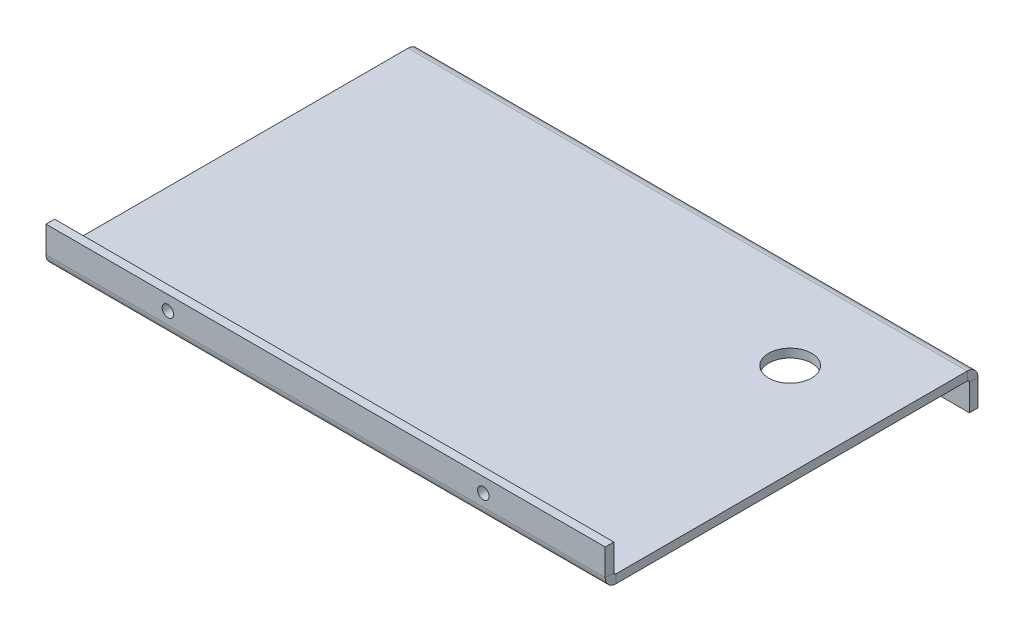
ISO-10303-21;
HEADER;
FILE_DESCRIPTION(('STEP AP214'),'2;1');
FILE_NAME('part.step','',(''),(''),'','','');
FILE_SCHEMA(('AUTOMOTIVE_DESIGN { 1 0 10303 214 1 1 1 1 }'));
ENDSEC;
DATA;
#1=APPLICATION_CONTEXT('core data for automotive mechanical design processes');
#2=APPLICATION_PROTOCOL_DEFINITION('international standard','automotive_design',2000,#1);
#3=PRODUCT_CONTEXT('',#1,'mechanical');
#4=PRODUCT('Part','Part','',(#3));
#5=PRODUCT_RELATED_PRODUCT_CATEGORY('part','',(#4));
#6=PRODUCT_DEFINITION_FORMATION('','',#4);
#7=PRODUCT_DEFINITION_CONTEXT('part definition',#1,'design');
#8=PRODUCT_DEFINITION('design','',#6,#7);
#9=PRODUCT_DEFINITION_SHAPE('','',#8);
#10=(LENGTH_UNIT() NAMED_UNIT(*) SI_UNIT(.MILLI.,.METRE.));
#11=(NAMED_UNIT(*) PLANE_ANGLE_UNIT() SI_UNIT($,.RADIAN.));
#12=(NAMED_UNIT(*) SI_UNIT($,.STERADIAN.) SOLID_ANGLE_UNIT());
#13=UNCERTAINTY_MEASURE_WITH_UNIT(LENGTH_MEASURE(1.E-05),#10,'distance_accuracy_value','');
#14=(GEOMETRIC_REPRESENTATION_CONTEXT(3) GLOBAL_UNCERTAINTY_ASSIGNED_CONTEXT((#13)) GLOBAL_UNIT_ASSIGNED_CONTEXT((#10,
#11,#12)) REPRESENTATION_CONTEXT('',''));
#15=CARTESIAN_POINT('',(0.,0.,0.));
#16=DIRECTION('',(0.,0.,1.));
#17=DIRECTION('',(1.,0.,0.));
#18=AXIS2_PLACEMENT_3D('',#15,#16,#17);
#19=CARTESIAN_POINT('',(97.5,-3.,65.));
#20=DIRECTION('',(1.,0.,0.));
#21=DIRECTION('',(0.,0.,-1.));
#22=AXIS2_PLACEMENT_3D('',#19,#20,#21);
#23=PLANE('',#22);
#24=DIRECTION('',(0.,0.,-1.));
#25=VECTOR('',#24,1.);
#26=CARTESIAN_POINT('',(97.5,-3.,65.));
#27=LINE('',#26,#25);
#28=CARTESIAN_POINT('',(97.5,-2.99999999999999,61.2634));
#29=VERTEX_POINT('',#28);
#30=CARTESIAN_POINT('',(97.5,-3.,-61.2634));
#31=VERTEX_POINT('',#30);
#32=EDGE_CURVE('E90',#29,#31,#27,.T.);
#33=ORIENTED_EDGE('',*,*,#32,.T.);
#34=DIRECTION('',(0.,1.,0.));
#35=VECTOR('',#34,1.);
#36=CARTESIAN_POINT('',(97.5,-3.00000000000001,-61.2634));
#37=LINE('',#36,#35);
#38=CARTESIAN_POINT('',(97.5,0.,-61.2634));
#39=VERTEX_POINT('',#38);
#40=EDGE_CURVE('E235',#31,#39,#37,.T.);
#41=ORIENTED_EDGE('',*,*,#40,.T.);
#42=DIRECTION('',(0.,0.,-1.));
#43=VECTOR('',#42,1.);
#44=CARTESIAN_POINT('',(97.5,0.,65.));
#45=LINE('',#44,#43);
#46=CARTESIAN_POINT('',(97.5,0.,61.2634));
#47=VERTEX_POINT('',#46);
#48=EDGE_CURVE('E325',#47,#39,#45,.T.);
#49=ORIENTED_EDGE('',*,*,#48,.F.);
#50=DIRECTION('',(0.,-1.,0.));
#51=VECTOR('',#50,1.);
#52=CARTESIAN_POINT('',(97.5,0.,61.2634));
#53=LINE('',#52,#51);
#54=EDGE_CURVE('E306',#47,#29,#53,.T.);
#55=ORIENTED_EDGE('',*,*,#54,.T.);
#56=EDGE_LOOP('',(#33,#41,#49,#55));
#57=FACE_BOUND('',#56,.T.);
#58=ADVANCED_FACE('F81',(#57),#23,.T.);
#59=CARTESIAN_POINT('',(0.,-3.,0.));
#60=DIRECTION('',(0.,-1.,0.));
#61=DIRECTION('',(0.,0.,-1.));
#62=AXIS2_PLACEMENT_3D('',#59,#60,#61);
#63=PLANE('',#62);
#64=CARTESIAN_POINT('',(65.,-3.,-32.));
#65=DIRECTION('',(0.,-1.,0.));
#66=DIRECTION('',(0.,0.,-1.));
#67=AXIS2_PLACEMENT_3D('',#64,#65,#66);
#68=CIRCLE('',#67,7.5);
#69=CARTESIAN_POINT('',(65.,-3.,-39.5));
#70=VERTEX_POINT('',#69);
#71=EDGE_CURVE('E721',#70,#70,#68,.T.);
#72=ORIENTED_EDGE('',*,*,#71,.F.);
#73=EDGE_LOOP('',(#72));
#74=FACE_BOUND('',#73,.T.);
#75=DIRECTION('',(0.,0.,1.));
#76=VECTOR('',#75,1.);
#77=CARTESIAN_POINT('',(-97.5,-3.,65.));
#78=LINE('',#77,#76);
#79=CARTESIAN_POINT('',(-97.5,-3.,-61.2634));
#80=VERTEX_POINT('',#79);
#81=CARTESIAN_POINT('',(-97.5,-3.,61.2634));
#82=VERTEX_POINT('',#81);
#83=EDGE_CURVE('E13',#80,#82,#78,.T.);
#84=ORIENTED_EDGE('',*,*,#83,.F.);
#85=DIRECTION('',(1.,0.,0.));
#86=VECTOR('',#85,1.);
#87=CARTESIAN_POINT('',(97.5,-3.00000000000001,-61.2634));
#88=LINE('',#87,#86);
#89=EDGE_CURVE('E98',#31,#80,#88,.F.);
#90=ORIENTED_EDGE('',*,*,#89,.F.);
#91=ORIENTED_EDGE('',*,*,#32,.F.);
#92=DIRECTION('',(1.,0.,0.));
#93=VECTOR('',#92,1.);
#94=CARTESIAN_POINT('',(97.4999999999999,-2.99999999999999,61.2634));
#95=LINE('',#94,#93);
#96=EDGE_CURVE('E297',#29,#82,#95,.F.);
#97=ORIENTED_EDGE('',*,*,#96,.T.);
#98=EDGE_LOOP('',(#84,#90,#91,#97));
#99=FACE_BOUND('',#98,.T.);
#100=ADVANCED_FACE('F409',(#74,#99),#63,.T.);
#101=CARTESIAN_POINT('',(0.,0.,0.));
#102=DIRECTION('',(0.,-1.,0.));
#103=DIRECTION('',(0.,0.,-1.));
#104=AXIS2_PLACEMENT_3D('',#101,#102,#103);
#105=PLANE('',#104);
#106=CARTESIAN_POINT('',(65.,0.,-32.));
#107=DIRECTION('',(0.,-1.,0.));
#108=DIRECTION('',(0.,0.,-1.));
#109=AXIS2_PLACEMENT_3D('',#106,#107,#108);
#110=CIRCLE('',#109,7.5);
#111=CARTESIAN_POINT('',(65.,0.,-39.5));
#112=VERTEX_POINT('',#111);
#113=EDGE_CURVE('E360',#112,#112,#110,.F.);
#114=ORIENTED_EDGE('',*,*,#113,.F.);
#115=EDGE_LOOP('',(#114));
#116=FACE_BOUND('',#115,.T.);
#117=DIRECTION('',(1.,0.,0.));
#118=VECTOR('',#117,1.);
#119=CARTESIAN_POINT('',(97.5,0.,-61.2634));
#120=LINE('',#119,#118);
#121=CARTESIAN_POINT('',(-97.5,0.,-61.2634));
#122=VERTEX_POINT('',#121);
#123=EDGE_CURVE('E226',#39,#122,#120,.F.);
#124=ORIENTED_EDGE('',*,*,#123,.T.);
#125=DIRECTION('',(0.,0.,1.));
#126=VECTOR('',#125,1.);
#127=CARTESIAN_POINT('',(-97.5,0.,65.));
#128=LINE('',#127,#126);
#129=CARTESIAN_POINT('',(-97.5,0.,61.2634));
#130=VERTEX_POINT('',#129);
#131=EDGE_CURVE('E330',#122,#130,#128,.T.);
#132=ORIENTED_EDGE('',*,*,#131,.T.);
#133=DIRECTION('',(1.,0.,0.));
#134=VECTOR('',#133,1.);
#135=CARTESIAN_POINT('',(97.4999999999999,0.,61.2634));
#136=LINE('',#135,#134);
#137=EDGE_CURVE('E314',#47,#130,#136,.F.);
#138=ORIENTED_EDGE('',*,*,#137,.F.);
#139=ORIENTED_EDGE('',*,*,#48,.T.);
#140=EDGE_LOOP('',(#124,#132,#138,#139));
#141=FACE_BOUND('',#140,.T.);
#142=ADVANCED_FACE('F392',(#116,#141),#105,.F.);
#143=CARTESIAN_POINT('',(-97.5,-3.,65.));
#144=DIRECTION('',(-1.,0.,0.));
#145=DIRECTION('',(0.,0.,1.));
#146=AXIS2_PLACEMENT_3D('',#143,#144,#145);
#147=PLANE('',#146);
#148=DIRECTION('',(0.,1.,0.));
#149=VECTOR('',#148,1.);
#150=CARTESIAN_POINT('',(-97.5,-3.00000000000001,-61.2634));
#151=LINE('',#150,#149);
#152=EDGE_CURVE('E105',#80,#122,#151,.T.);
#153=ORIENTED_EDGE('',*,*,#152,.F.);
#154=ORIENTED_EDGE('',*,*,#83,.T.);
#155=DIRECTION('',(0.,-1.,0.));
#156=VECTOR('',#155,1.);
#157=CARTESIAN_POINT('',(-97.5,0.,61.2634));
#158=LINE('',#157,#156);
#159=EDGE_CURVE('E321',#130,#82,#158,.T.);
#160=ORIENTED_EDGE('',*,*,#159,.F.);
#161=ORIENTED_EDGE('',*,*,#131,.F.);
#162=EDGE_LOOP('',(#153,#154,#160,#161));
#163=FACE_BOUND('',#162,.T.);
#164=ADVANCED_FACE('F418',(#163),#147,.T.);
#165=CARTESIAN_POINT('',(-97.5,0.736600000000004,61.2634));
#166=DIRECTION('',(-1.,0.,0.));
#167=DIRECTION('',(0.,0.,1.));
#168=AXIS2_PLACEMENT_3D('',#165,#166,#167);
#169=PLANE('',#168);
#170=DIRECTION('',(0.,0.,-1.));
#171=VECTOR('',#170,1.);
#172=CARTESIAN_POINT('',(-97.5,0.736600000000004,65.));
#173=LINE('',#172,#171);
#174=CARTESIAN_POINT('',(-97.5,0.736600000000004,62.));
#175=VERTEX_POINT('',#174);
#176=CARTESIAN_POINT('',(-97.4999999999999,0.736600000000004,65.));
#177=VERTEX_POINT('',#176);
#178=EDGE_CURVE('E251',#175,#177,#173,.F.);
#179=ORIENTED_EDGE('',*,*,#178,.F.);
#180=CARTESIAN_POINT('',(-97.5,0.736600000000004,61.2634));
#181=DIRECTION('',(1.,0.,0.));
#182=DIRECTION('',(0.,0.,-1.));
#183=AXIS2_PLACEMENT_3D('',#180,#181,#182);
#184=CIRCLE('',#183,0.736599999999997);
#185=EDGE_CURVE('E310',#130,#175,#184,.F.);
#186=ORIENTED_EDGE('',*,*,#185,.F.);
#187=ORIENTED_EDGE('',*,*,#159,.T.);
#188=CARTESIAN_POINT('',(-97.4999999999999,0.736600000000004,61.2634));
#189=DIRECTION('',(1.,0.,0.));
#190=DIRECTION('',(0.,0.,-1.));
#191=AXIS2_PLACEMENT_3D('',#188,#189,#190);
#192=CIRCLE('',#191,3.7366);
#193=EDGE_CURVE('E301',#82,#177,#192,.F.);
#194=ORIENTED_EDGE('',*,*,#193,.T.);
#195=EDGE_LOOP('',(#179,#186,#187,#194));
#196=FACE_BOUND('',#195,.T.);
#197=ADVANCED_FACE('F426',(#196),#169,.T.);
#198=CARTESIAN_POINT('',(97.5,0.736600000000004,61.2634));
#199=DIRECTION('',(-1.,0.,0.));
#200=DIRECTION('',(0.,0.,1.));
#201=AXIS2_PLACEMENT_3D('',#198,#199,#200);
#202=PLANE('',#201);
#203=CARTESIAN_POINT('',(97.5,0.736600000000004,61.2634));
#204=DIRECTION('',(1.,0.,0.));
#205=DIRECTION('',(0.,0.,-1.));
#206=AXIS2_PLACEMENT_3D('',#203,#204,#205);
#207=CIRCLE('',#206,0.736599999999997);
#208=CARTESIAN_POINT('',(97.5,0.736600000000004,62.));
#209=VERTEX_POINT('',#208);
#210=EDGE_CURVE('E259',#209,#47,#207,.T.);
#211=ORIENTED_EDGE('',*,*,#210,.F.);
#212=DIRECTION('',(0.,0.,-1.));
#213=VECTOR('',#212,1.);
#214=CARTESIAN_POINT('',(97.5,0.736600000000004,62.));
#215=LINE('',#214,#213);
#216=CARTESIAN_POINT('',(97.5,0.736600000000004,65.));
#217=VERTEX_POINT('',#216);
#218=EDGE_CURVE('E287',#209,#217,#215,.F.);
#219=ORIENTED_EDGE('',*,*,#218,.T.);
#220=CARTESIAN_POINT('',(97.5,0.736600000000004,61.2634));
#221=DIRECTION('',(1.,0.,0.));
#222=DIRECTION('',(0.,0.,-1.));
#223=AXIS2_PLACEMENT_3D('',#220,#221,#222);
#224=CIRCLE('',#223,3.7366);
#225=EDGE_CURVE('E302',#217,#29,#224,.T.);
#226=ORIENTED_EDGE('',*,*,#225,.T.);
#227=ORIENTED_EDGE('',*,*,#54,.F.);
#228=EDGE_LOOP('',(#211,#219,#226,#227));
#229=FACE_BOUND('',#228,.T.);
#230=ADVANCED_FACE('F423',(#229),#202,.F.);
#231=CARTESIAN_POINT('',(97.4999999999999,0.736600000000004,61.2634));
#232=DIRECTION('',(1.,0.,0.));
#233=DIRECTION('',(0.,0.,1.));
#234=AXIS2_PLACEMENT_3D('',#231,#232,#233);
#235=CYLINDRICAL_SURFACE('',#234,3.7366);
#236=ORIENTED_EDGE('',*,*,#96,.F.);
#237=ORIENTED_EDGE('',*,*,#225,.F.);
#238=DIRECTION('',(1.,0.,0.));
#239=VECTOR('',#238,1.);
#240=CARTESIAN_POINT('',(-97.5,0.736600000000004,65.));
#241=LINE('',#240,#239);
#242=EDGE_CURVE('E284',#217,#177,#241,.F.);
#243=ORIENTED_EDGE('',*,*,#242,.T.);
#244=ORIENTED_EDGE('',*,*,#193,.F.);
#245=EDGE_LOOP('',(#236,#237,#243,#244));
#246=FACE_BOUND('',#245,.T.);
#247=ADVANCED_FACE('F434',(#246),#235,.T.);
#248=CARTESIAN_POINT('',(97.4999999999999,0.736600000000004,61.2634));
#249=DIRECTION('',(1.,0.,0.));
#250=DIRECTION('',(0.,0.,1.));
#251=AXIS2_PLACEMENT_3D('',#248,#249,#250);
#252=CYLINDRICAL_SURFACE('',#251,0.736599999999997);
#253=ORIENTED_EDGE('',*,*,#137,.T.);
#254=ORIENTED_EDGE('',*,*,#185,.T.);
#255=DIRECTION('',(1.,0.,0.));
#256=VECTOR('',#255,1.);
#257=CARTESIAN_POINT('',(-97.5,0.736600000000004,62.));
#258=LINE('',#257,#256);
#259=EDGE_CURVE('E291',#175,#209,#258,.T.);
#260=ORIENTED_EDGE('',*,*,#259,.T.);
#261=ORIENTED_EDGE('',*,*,#210,.T.);
#262=EDGE_LOOP('',(#253,#254,#260,#261));
#263=FACE_BOUND('',#262,.T.);
#264=ADVANCED_FACE('F437',(#263),#252,.F.);
#265=CARTESIAN_POINT('',(97.5,10.,65.));
#266=DIRECTION('',(-1.,0.,0.));
#267=DIRECTION('',(0.,-1.,0.));
#268=AXIS2_PLACEMENT_3D('',#265,#266,#267);
#269=PLANE('',#268);
#270=ORIENTED_EDGE('',*,*,#218,.F.);
#271=DIRECTION('',(0.,-1.,0.));
#272=VECTOR('',#271,1.);
#273=CARTESIAN_POINT('',(97.5,10.,62.));
#274=LINE('',#273,#272);
#275=CARTESIAN_POINT('',(97.5,10.,62.));
#276=VERTEX_POINT('',#275);
#277=EDGE_CURVE('E281',#209,#276,#274,.F.);
#278=ORIENTED_EDGE('',*,*,#277,.T.);
#279=DIRECTION('',(0.,0.,-1.));
#280=VECTOR('',#279,1.);
#281=CARTESIAN_POINT('',(97.5,10.,65.));
#282=LINE('',#281,#280);
#283=CARTESIAN_POINT('',(97.5,10.,65.));
#284=VERTEX_POINT('',#283);
#285=EDGE_CURVE('E255',#284,#276,#282,.T.);
#286=ORIENTED_EDGE('',*,*,#285,.F.);
#287=DIRECTION('',(0.,1.,0.));
#288=VECTOR('',#287,1.);
#289=CARTESIAN_POINT('',(97.5,-4.05925293378573E-13,65.));
#290=LINE('',#289,#288);
#291=EDGE_CURVE('E271',#217,#284,#290,.T.);
#292=ORIENTED_EDGE('',*,*,#291,.F.);
#293=EDGE_LOOP('',(#270,#278,#286,#292));
#294=FACE_BOUND('',#293,.T.);
#295=ADVANCED_FACE('F440',(#294),#269,.F.);
#296=CARTESIAN_POINT('',(-97.5,0.,65.));
#297=DIRECTION('',(1.,0.,0.));
#298=DIRECTION('',(0.,1.,0.));
#299=AXIS2_PLACEMENT_3D('',#296,#297,#298);
#300=PLANE('',#299);
#301=ORIENTED_EDGE('',*,*,#178,.T.);
#302=DIRECTION('',(0.,-1.,0.));
#303=VECTOR('',#302,1.);
#304=CARTESIAN_POINT('',(-97.5,5.41233724504764E-13,65.));
#305=LINE('',#304,#303);
#306=CARTESIAN_POINT('',(-97.5,10.,65.));
#307=VERTEX_POINT('',#306);
#308=EDGE_CURVE('E264',#307,#177,#305,.T.);
#309=ORIENTED_EDGE('',*,*,#308,.F.);
#310=DIRECTION('',(0.,0.,-1.));
#311=VECTOR('',#310,1.);
#312=CARTESIAN_POINT('',(-97.5,10.,65.));
#313=LINE('',#312,#311);
#314=CARTESIAN_POINT('',(-97.5,10.,62.));
#315=VERTEX_POINT('',#314);
#316=EDGE_CURVE('E260',#307,#315,#313,.T.);
#317=ORIENTED_EDGE('',*,*,#316,.T.);
#318=DIRECTION('',(0.,1.,0.));
#319=VECTOR('',#318,1.);
#320=CARTESIAN_POINT('',(-97.5,0.,62.));
#321=LINE('',#320,#319);
#322=EDGE_CURVE('E274',#315,#175,#321,.F.);
#323=ORIENTED_EDGE('',*,*,#322,.T.);
#324=EDGE_LOOP('',(#301,#309,#317,#323));
#325=FACE_BOUND('',#324,.T.);
#326=ADVANCED_FACE('F446',(#325),#300,.F.);
#327=CARTESIAN_POINT('',(0.,0.,65.));
#328=DIRECTION('',(0.,0.,-1.));
#329=DIRECTION('',(-1.,0.,0.));
#330=AXIS2_PLACEMENT_3D('',#327,#328,#329);
#331=PLANE('',#330);
#332=CARTESIAN_POINT('',(-55.,5.00000000000001,65.));
#333=DIRECTION('',(0.,0.,1.));
#334=DIRECTION('',(1.,0.,0.));
#335=AXIS2_PLACEMENT_3D('',#332,#333,#334);
#336=CIRCLE('',#335,2.);
#337=CARTESIAN_POINT('',(-53.,5.00000000000001,65.));
#338=VERTEX_POINT('',#337);
#339=EDGE_CURVE('E340',#338,#338,#336,.T.);
#340=ORIENTED_EDGE('',*,*,#339,.F.);
#341=EDGE_LOOP('',(#340));
#342=FACE_BOUND('',#341,.T.);
#343=CARTESIAN_POINT('',(55.,5.00000000000002,65.));
#344=DIRECTION('',(0.,0.,1.));
#345=DIRECTION('',(-1.,0.,0.));
#346=AXIS2_PLACEMENT_3D('',#343,#344,#345);
#347=CIRCLE('',#346,2.);
#348=CARTESIAN_POINT('',(53.,5.00000000000002,65.));
#349=VERTEX_POINT('',#348);
#350=EDGE_CURVE('E352',#349,#349,#347,.T.);
#351=ORIENTED_EDGE('',*,*,#350,.F.);
#352=EDGE_LOOP('',(#351));
#353=FACE_BOUND('',#352,.T.);
#354=ORIENTED_EDGE('',*,*,#242,.F.);
#355=ORIENTED_EDGE('',*,*,#291,.T.);
#356=DIRECTION('',(-1.,0.,0.));
#357=VECTOR('',#356,1.);
#358=CARTESIAN_POINT('',(0.,10.,65.));
#359=LINE('',#358,#357);
#360=EDGE_CURVE('E268',#284,#307,#359,.T.);
#361=ORIENTED_EDGE('',*,*,#360,.T.);
#362=ORIENTED_EDGE('',*,*,#308,.T.);
#363=EDGE_LOOP('',(#354,#355,#361,#362));
#364=FACE_BOUND('',#363,.T.);
#365=ADVANCED_FACE('F451',(#342,#353,#364),#331,.F.);
#366=CARTESIAN_POINT('',(0.,0.,62.));
#367=DIRECTION('',(0.,0.,-1.));
#368=DIRECTION('',(-1.,0.,0.));
#369=AXIS2_PLACEMENT_3D('',#366,#367,#368);
#370=PLANE('',#369);
#371=CARTESIAN_POINT('',(-55.,5.00000000000001,62.));
#372=DIRECTION('',(0.,0.,-1.));
#373=DIRECTION('',(-1.,0.,0.));
#374=AXIS2_PLACEMENT_3D('',#371,#372,#373);
#375=CIRCLE('',#374,2.);
#376=CARTESIAN_POINT('',(-57.,5.00000000000001,62.));
#377=VERTEX_POINT('',#376);
#378=EDGE_CURVE('E225',#377,#377,#375,.T.);
#379=ORIENTED_EDGE('',*,*,#378,.F.);
#380=EDGE_LOOP('',(#379));
#381=FACE_BOUND('',#380,.T.);
#382=CARTESIAN_POINT('',(55.,5.00000000000002,62.));
#383=DIRECTION('',(0.,0.,-1.));
#384=DIRECTION('',(-1.,0.,0.));
#385=AXIS2_PLACEMENT_3D('',#382,#383,#384);
#386=CIRCLE('',#385,2.);
#387=CARTESIAN_POINT('',(53.,5.00000000000002,62.));
#388=VERTEX_POINT('',#387);
#389=EDGE_CURVE('E336',#388,#388,#386,.T.);
#390=ORIENTED_EDGE('',*,*,#389,.F.);
#391=EDGE_LOOP('',(#390));
#392=FACE_BOUND('',#391,.T.);
#393=ORIENTED_EDGE('',*,*,#277,.F.);
#394=ORIENTED_EDGE('',*,*,#259,.F.);
#395=ORIENTED_EDGE('',*,*,#322,.F.);
#396=DIRECTION('',(1.,0.,0.));
#397=VECTOR('',#396,1.);
#398=CARTESIAN_POINT('',(-97.5,10.,62.));
#399=LINE('',#398,#397);
#400=EDGE_CURVE('E278',#276,#315,#399,.F.);
#401=ORIENTED_EDGE('',*,*,#400,.F.);
#402=EDGE_LOOP('',(#393,#394,#395,#401));
#403=FACE_BOUND('',#402,.T.);
#404=ADVANCED_FACE('F404',(#381,#392,#403),#370,.T.);
#405=CARTESIAN_POINT('',(-97.5,10.,65.));
#406=DIRECTION('',(0.,-1.,0.));
#407=DIRECTION('',(0.,0.,-1.));
#408=AXIS2_PLACEMENT_3D('',#405,#406,#407);
#409=PLANE('',#408);
#410=ORIENTED_EDGE('',*,*,#400,.T.);
#411=ORIENTED_EDGE('',*,*,#316,.F.);
#412=ORIENTED_EDGE('',*,*,#360,.F.);
#413=ORIENTED_EDGE('',*,*,#285,.T.);
#414=EDGE_LOOP('',(#410,#411,#412,#413));
#415=FACE_BOUND('',#414,.T.);
#416=ADVANCED_FACE('F397',(#415),#409,.F.);
#417=CARTESIAN_POINT('',(-97.5,-3.73660000000001,-61.2634));
#418=DIRECTION('',(-1.,0.,0.));
#419=DIRECTION('',(0.,0.,1.));
#420=AXIS2_PLACEMENT_3D('',#417,#418,#419);
#421=PLANE('',#420);
#422=DIRECTION('',(0.,0.,1.));
#423=VECTOR('',#422,1.);
#424=CARTESIAN_POINT('',(-97.5,-3.73659999999999,-65.));
#425=LINE('',#424,#423);
#426=CARTESIAN_POINT('',(-97.5,-3.73660000000001,-62.));
#427=VERTEX_POINT('',#426);
#428=CARTESIAN_POINT('',(-97.5,-3.7366,-65.));
#429=VERTEX_POINT('',#428);
#430=EDGE_CURVE('E198',#427,#429,#425,.F.);
#431=ORIENTED_EDGE('',*,*,#430,.F.);
#432=CARTESIAN_POINT('',(-97.5,-3.73660000000001,-61.2634));
#433=DIRECTION('',(1.,0.,0.));
#434=DIRECTION('',(0.,0.,-1.));
#435=AXIS2_PLACEMENT_3D('',#432,#433,#434);
#436=CIRCLE('',#435,0.736599999999997);
#437=EDGE_CURVE('E239',#80,#427,#436,.F.);
#438=ORIENTED_EDGE('',*,*,#437,.F.);
#439=ORIENTED_EDGE('',*,*,#152,.T.);
#440=CARTESIAN_POINT('',(-97.5,-3.73660000000001,-61.2634));
#441=DIRECTION('',(1.,0.,0.));
#442=DIRECTION('',(0.,0.,-1.));
#443=AXIS2_PLACEMENT_3D('',#440,#441,#442);
#444=CIRCLE('',#443,3.7366);
#445=EDGE_CURVE('E230',#122,#429,#444,.F.);
#446=ORIENTED_EDGE('',*,*,#445,.T.);
#447=EDGE_LOOP('',(#431,#438,#439,#446));
#448=FACE_BOUND('',#447,.T.);
#449=ADVANCED_FACE('F395',(#448),#421,.T.);
#450=CARTESIAN_POINT('',(97.5,-3.73660000000001,-61.2634));
#451=DIRECTION('',(-1.,0.,0.));
#452=DIRECTION('',(0.,0.,1.));
#453=AXIS2_PLACEMENT_3D('',#450,#451,#452);
#454=PLANE('',#453);
#455=CARTESIAN_POINT('',(97.5,-3.73660000000001,-61.2634));
#456=DIRECTION('',(1.,0.,0.));
#457=DIRECTION('',(0.,0.,-1.));
#458=AXIS2_PLACEMENT_3D('',#455,#456,#457);
#459=CIRCLE('',#458,0.736599999999997);
#460=CARTESIAN_POINT('',(97.5,-3.73660000000001,-62.));
#461=VERTEX_POINT('',#460);
#462=EDGE_CURVE('E245',#461,#31,#459,.T.);
#463=ORIENTED_EDGE('',*,*,#462,.F.);
#464=DIRECTION('',(0.,0.,1.));
#465=VECTOR('',#464,1.);
#466=CARTESIAN_POINT('',(97.5,-3.73660000000001,-62.));
#467=LINE('',#466,#465);
#468=CARTESIAN_POINT('',(97.5,-3.73659999999999,-65.));
#469=VERTEX_POINT('',#468);
#470=EDGE_CURVE('E216',#461,#469,#467,.F.);
#471=ORIENTED_EDGE('',*,*,#470,.T.);
#472=CARTESIAN_POINT('',(97.5,-3.73660000000001,-61.2634));
#473=DIRECTION('',(1.,0.,0.));
#474=DIRECTION('',(0.,0.,-1.));
#475=AXIS2_PLACEMENT_3D('',#472,#473,#474);
#476=CIRCLE('',#475,3.7366);
#477=EDGE_CURVE('E231',#469,#39,#476,.T.);
#478=ORIENTED_EDGE('',*,*,#477,.T.);
#479=ORIENTED_EDGE('',*,*,#40,.F.);
#480=EDGE_LOOP('',(#463,#471,#478,#479));
#481=FACE_BOUND('',#480,.T.);
#482=ADVANCED_FACE('F384',(#481),#454,.F.);
#483=CARTESIAN_POINT('',(97.5,-3.73660000000001,-61.2634));
#484=DIRECTION('',(1.,0.,0.));
#485=DIRECTION('',(0.,0.,-1.));
#486=AXIS2_PLACEMENT_3D('',#483,#484,#485);
#487=CYLINDRICAL_SURFACE('',#486,3.7366);
#488=ORIENTED_EDGE('',*,*,#123,.F.);
#489=ORIENTED_EDGE('',*,*,#477,.F.);
#490=DIRECTION('',(1.,0.,0.));
#491=VECTOR('',#490,1.);
#492=CARTESIAN_POINT('',(-97.5,-3.73659999999999,-65.));
#493=LINE('',#492,#491);
#494=EDGE_CURVE('E213',#469,#429,#493,.F.);
#495=ORIENTED_EDGE('',*,*,#494,.T.);
#496=ORIENTED_EDGE('',*,*,#445,.F.);
#497=EDGE_LOOP('',(#488,#489,#495,#496));
#498=FACE_BOUND('',#497,.T.);
#499=ADVANCED_FACE('F390',(#498),#487,.T.);
#500=CARTESIAN_POINT('',(97.5,-3.73660000000001,-61.2634));
#501=DIRECTION('',(1.,0.,0.));
#502=DIRECTION('',(0.,0.,-1.));
#503=AXIS2_PLACEMENT_3D('',#500,#501,#502);
#504=CYLINDRICAL_SURFACE('',#503,0.736599999999997);
#505=ORIENTED_EDGE('',*,*,#89,.T.);
#506=ORIENTED_EDGE('',*,*,#437,.T.);
#507=DIRECTION('',(1.,0.,0.));
#508=VECTOR('',#507,1.);
#509=CARTESIAN_POINT('',(-97.5,-3.73660000000001,-62.));
#510=LINE('',#509,#508);
#511=EDGE_CURVE('E220',#427,#461,#510,.T.);
#512=ORIENTED_EDGE('',*,*,#511,.T.);
#513=ORIENTED_EDGE('',*,*,#462,.T.);
#514=EDGE_LOOP('',(#505,#506,#512,#513));
#515=FACE_BOUND('',#514,.T.);
#516=ADVANCED_FACE('F380',(#515),#504,.F.);
#517=CARTESIAN_POINT('',(97.5,-13.,-65.));
#518=DIRECTION('',(-1.,0.,0.));
#519=DIRECTION('',(0.,-1.,0.));
#520=AXIS2_PLACEMENT_3D('',#517,#518,#519);
#521=PLANE('',#520);
#522=ORIENTED_EDGE('',*,*,#470,.F.);
#523=DIRECTION('',(0.,1.,0.));
#524=VECTOR('',#523,1.);
#525=CARTESIAN_POINT('',(97.5,-13.,-62.));
#526=LINE('',#525,#524);
#527=CARTESIAN_POINT('',(97.5,-13.,-62.));
#528=VERTEX_POINT('',#527);
#529=EDGE_CURVE('E210',#461,#528,#526,.F.);
#530=ORIENTED_EDGE('',*,*,#529,.T.);
#531=DIRECTION('',(0.,0.,1.));
#532=VECTOR('',#531,1.);
#533=CARTESIAN_POINT('',(97.5,-13.,-65.));
#534=LINE('',#533,#532);
#535=CARTESIAN_POINT('',(97.5,-13.,-65.));
#536=VERTEX_POINT('',#535);
#537=EDGE_CURVE('E194',#536,#528,#534,.T.);
#538=ORIENTED_EDGE('',*,*,#537,.F.);
#539=DIRECTION('',(0.,-1.,0.));
#540=VECTOR('',#539,1.);
#541=CARTESIAN_POINT('',(97.4999999999999,6.87016599647484E-13,-65.));
#542=LINE('',#541,#540);
#543=EDGE_CURVE('E179',#469,#536,#542,.T.);
#544=ORIENTED_EDGE('',*,*,#543,.F.);
#545=EDGE_LOOP('',(#522,#530,#538,#544));
#546=FACE_BOUND('',#545,.T.);
#547=ADVANCED_FACE('F373',(#546),#521,.F.);
#548=CARTESIAN_POINT('',(-97.5,-2.99999999999999,-65.));
#549=DIRECTION('',(1.,0.,0.));
#550=DIRECTION('',(0.,1.,0.));
#551=AXIS2_PLACEMENT_3D('',#548,#549,#550);
#552=PLANE('',#551);
#553=ORIENTED_EDGE('',*,*,#430,.T.);
#554=DIRECTION('',(0.,1.,0.));
#555=VECTOR('',#554,1.);
#556=CARTESIAN_POINT('',(-97.5000000000001,-2.60142418235853E-13,-65.));
#557=LINE('',#556,#555);
#558=CARTESIAN_POINT('',(-97.5,-13.,-65.));
#559=VERTEX_POINT('',#558);
#560=EDGE_CURVE('E177',#559,#429,#557,.T.);
#561=ORIENTED_EDGE('',*,*,#560,.F.);
#562=DIRECTION('',(0.,0.,1.));
#563=VECTOR('',#562,1.);
#564=CARTESIAN_POINT('',(-97.5,-13.,-65.));
#565=LINE('',#564,#563);
#566=CARTESIAN_POINT('',(-97.5,-13.,-62.));
#567=VERTEX_POINT('',#566);
#568=EDGE_CURVE('E186',#559,#567,#565,.T.);
#569=ORIENTED_EDGE('',*,*,#568,.T.);
#570=DIRECTION('',(0.,-1.,0.));
#571=VECTOR('',#570,1.);
#572=CARTESIAN_POINT('',(-97.5,-3.,-62.));
#573=LINE('',#572,#571);
#574=EDGE_CURVE('E205',#567,#427,#573,.F.);
#575=ORIENTED_EDGE('',*,*,#574,.T.);
#576=EDGE_LOOP('',(#553,#561,#569,#575));
#577=FACE_BOUND('',#576,.T.);
#578=ADVANCED_FACE('F197',(#577),#552,.F.);
#579=CARTESIAN_POINT('',(0.,2.81091306268911E-13,-65.));
#580=DIRECTION('',(0.,0.,1.));
#581=DIRECTION('',(0.,-1.,0.));
#582=AXIS2_PLACEMENT_3D('',#579,#580,#581);
#583=PLANE('',#582);
#584=CARTESIAN_POINT('',(55.,-7.9999999999999,-65.));
#585=DIRECTION('',(0.,0.,-1.));
#586=DIRECTION('',(0.,1.,0.));
#587=AXIS2_PLACEMENT_3D('',#584,#585,#586);
#588=CIRCLE('',#587,2.);
#589=CARTESIAN_POINT('',(55.,-5.9999999999999,-65.));
#590=VERTEX_POINT('',#589);
#591=EDGE_CURVE('E346',#590,#590,#588,.T.);
#592=ORIENTED_EDGE('',*,*,#591,.F.);
#593=EDGE_LOOP('',(#592));
#594=FACE_BOUND('',#593,.T.);
#595=CARTESIAN_POINT('',(-55.,-7.99999999999989,-65.));
#596=DIRECTION('',(0.,0.,-1.));
#597=DIRECTION('',(0.,-1.,0.));
#598=AXIS2_PLACEMENT_3D('',#595,#596,#597);
#599=CIRCLE('',#598,2.);
#600=CARTESIAN_POINT('',(-55.,-9.99999999999989,-65.));
#601=VERTEX_POINT('',#600);
#602=EDGE_CURVE('E354',#601,#601,#599,.T.);
#603=ORIENTED_EDGE('',*,*,#602,.F.);
#604=EDGE_LOOP('',(#603));
#605=FACE_BOUND('',#604,.T.);
#606=ORIENTED_EDGE('',*,*,#494,.F.);
#607=ORIENTED_EDGE('',*,*,#543,.T.);
#608=DIRECTION('',(-1.,0.,0.));
#609=VECTOR('',#608,1.);
#610=CARTESIAN_POINT('',(0.,-13.,-65.));
#611=LINE('',#610,#609);
#612=EDGE_CURVE('E172',#536,#559,#611,.T.);
#613=ORIENTED_EDGE('',*,*,#612,.T.);
#614=ORIENTED_EDGE('',*,*,#560,.T.);
#615=EDGE_LOOP('',(#606,#607,#613,#614));
#616=FACE_BOUND('',#615,.T.);
#617=ADVANCED_FACE('F175',(#594,#605,#616),#583,.F.);
#618=CARTESIAN_POINT('',(0.,2.70616862252382E-13,-62.));
#619=DIRECTION('',(0.,0.,1.));
#620=DIRECTION('',(0.,-1.,0.));
#621=AXIS2_PLACEMENT_3D('',#618,#619,#620);
#622=PLANE('',#621);
#623=CARTESIAN_POINT('',(55.,-7.99999999999991,-62.));
#624=DIRECTION('',(0.,0.,1.));
#625=DIRECTION('',(0.,-1.,0.));
#626=AXIS2_PLACEMENT_3D('',#623,#624,#625);
#627=CIRCLE('',#626,2.);
#628=CARTESIAN_POINT('',(55.,-9.99999999999991,-62.));
#629=VERTEX_POINT('',#628);
#630=EDGE_CURVE('E84',#629,#629,#627,.T.);
#631=ORIENTED_EDGE('',*,*,#630,.F.);
#632=EDGE_LOOP('',(#631));
#633=FACE_BOUND('',#632,.T.);
#634=CARTESIAN_POINT('',(-55.,-7.9999999999999,-62.));
#635=DIRECTION('',(0.,0.,1.));
#636=DIRECTION('',(0.,-1.,0.));
#637=AXIS2_PLACEMENT_3D('',#634,#635,#636);
#638=CIRCLE('',#637,2.);
#639=CARTESIAN_POINT('',(-55.,-9.9999999999999,-62.));
#640=VERTEX_POINT('',#639);
#641=EDGE_CURVE('E343',#640,#640,#638,.T.);
#642=ORIENTED_EDGE('',*,*,#641,.F.);
#643=EDGE_LOOP('',(#642));
#644=FACE_BOUND('',#643,.T.);
#645=ORIENTED_EDGE('',*,*,#529,.F.);
#646=ORIENTED_EDGE('',*,*,#511,.F.);
#647=ORIENTED_EDGE('',*,*,#574,.F.);
#648=DIRECTION('',(1.,0.,0.));
#649=VECTOR('',#648,1.);
#650=CARTESIAN_POINT('',(-97.5,-13.,-62.));
#651=LINE('',#650,#649);
#652=EDGE_CURVE('E189',#528,#567,#651,.F.);
#653=ORIENTED_EDGE('',*,*,#652,.F.);
#654=EDGE_LOOP('',(#645,#646,#647,#653));
#655=FACE_BOUND('',#654,.T.);
#656=ADVANCED_FACE('F377',(#633,#644,#655),#622,.T.);
#657=CARTESIAN_POINT('',(-97.5,-13.,-65.));
#658=DIRECTION('',(0.,1.,0.));
#659=DIRECTION('',(0.,0.,1.));
#660=AXIS2_PLACEMENT_3D('',#657,#658,#659);
#661=PLANE('',#660);
#662=ORIENTED_EDGE('',*,*,#652,.T.);
#663=ORIENTED_EDGE('',*,*,#568,.F.);
#664=ORIENTED_EDGE('',*,*,#612,.F.);
#665=ORIENTED_EDGE('',*,*,#537,.T.);
#666=EDGE_LOOP('',(#662,#663,#664,#665));
#667=FACE_BOUND('',#666,.T.);
#668=ADVANCED_FACE('F187',(#667),#661,.F.);
#669=CARTESIAN_POINT('',(55.,5.00000000000002,55.));
#670=DIRECTION('',(0.,0.,1.));
#671=DIRECTION('',(1.,0.,0.));
#672=AXIS2_PLACEMENT_3D('',#669,#670,#671);
#673=CYLINDRICAL_SURFACE('',#672,2.);
#674=ORIENTED_EDGE('',*,*,#389,.T.);
#675=EDGE_LOOP('',(#674));
#676=FACE_BOUND('',#675,.T.);
#677=ORIENTED_EDGE('',*,*,#350,.T.);
#678=EDGE_LOOP('',(#677));
#679=FACE_BOUND('',#678,.T.);
#680=ADVANCED_FACE('F481',(#676,#679),#673,.F.);
#681=CARTESIAN_POINT('',(-55.,5.00000000000001,55.));
#682=DIRECTION('',(0.,0.,1.));
#683=DIRECTION('',(1.,0.,0.));
#684=AXIS2_PLACEMENT_3D('',#681,#682,#683);
#685=CYLINDRICAL_SURFACE('',#684,2.);
#686=ORIENTED_EDGE('',*,*,#378,.T.);
#687=EDGE_LOOP('',(#686));
#688=FACE_BOUND('',#687,.T.);
#689=ORIENTED_EDGE('',*,*,#339,.T.);
#690=EDGE_LOOP('',(#689));
#691=FACE_BOUND('',#690,.T.);
#692=ADVANCED_FACE('F483',(#688,#691),#685,.F.);
#693=CARTESIAN_POINT('',(-55.,-7.99999999999992,-55.));
#694=DIRECTION('',(0.,0.,-1.));
#695=DIRECTION('',(0.,1.,0.));
#696=AXIS2_PLACEMENT_3D('',#693,#694,#695);
#697=CYLINDRICAL_SURFACE('',#696,2.);
#698=ORIENTED_EDGE('',*,*,#641,.T.);
#699=EDGE_LOOP('',(#698));
#700=FACE_BOUND('',#699,.T.);
#701=ORIENTED_EDGE('',*,*,#602,.T.);
#702=EDGE_LOOP('',(#701));
#703=FACE_BOUND('',#702,.T.);
#704=ADVANCED_FACE('F490',(#700,#703),#697,.F.);
#705=CARTESIAN_POINT('',(55.,-7.99999999999993,-55.));
#706=DIRECTION('',(0.,0.,-1.));
#707=DIRECTION('',(0.,1.,0.));
#708=AXIS2_PLACEMENT_3D('',#705,#706,#707);
#709=CYLINDRICAL_SURFACE('',#708,2.);
#710=ORIENTED_EDGE('',*,*,#630,.T.);
#711=EDGE_LOOP('',(#710));
#712=FACE_BOUND('',#711,.T.);
#713=ORIENTED_EDGE('',*,*,#591,.T.);
#714=EDGE_LOOP('',(#713));
#715=FACE_BOUND('',#714,.T.);
#716=ADVANCED_FACE('F568',(#712,#715),#709,.F.);
#717=CARTESIAN_POINT('',(65.,10.001,-32.));
#718=DIRECTION('',(0.,-1.,0.));
#719=DIRECTION('',(0.,0.,-1.));
#720=AXIS2_PLACEMENT_3D('',#717,#718,#719);
#721=CYLINDRICAL_SURFACE('',#720,7.5);
#722=ORIENTED_EDGE('',*,*,#71,.T.);
#723=EDGE_LOOP('',(#722));
#724=FACE_BOUND('',#723,.T.);
#725=ORIENTED_EDGE('',*,*,#113,.T.);
#726=EDGE_LOOP('',(#725));
#727=FACE_BOUND('',#726,.T.);
#728=ADVANCED_FACE('F573',(#724,#727),#721,.F.);
#729=CLOSED_SHELL('',(#58,#100,#142,#164,#197,#230,#247,#264,#295,#326,#365,#404,#416,#449,#482,
#499,#516,#547,#578,#617,#656,#668,#680,#692,#704,#716,#728));
#730=MANIFOLD_SOLID_BREP('B2',#729);
#731=ADVANCED_BREP_SHAPE_REPRESENTATION('',(#18,#730),#14);
#732=SHAPE_DEFINITION_REPRESENTATION(#9,#731);
ENDSEC;
END-ISO-10303-21;
